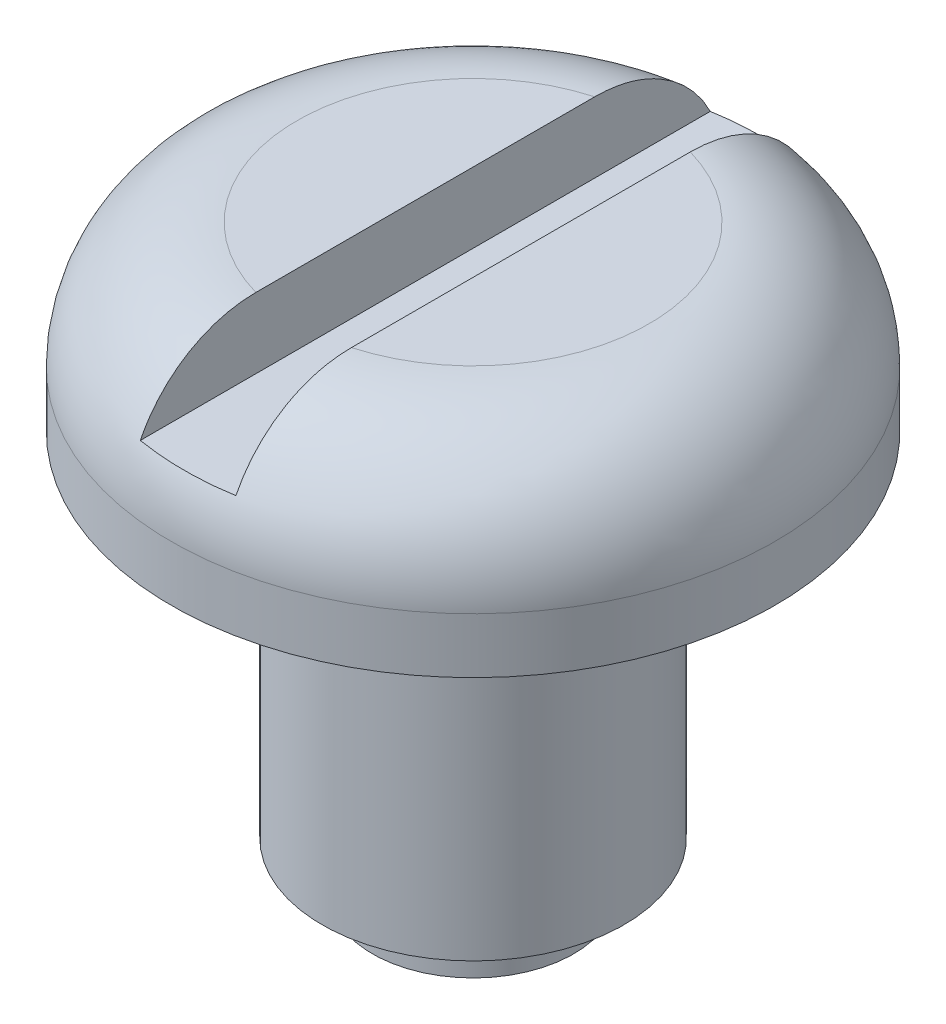
ISO-10303-21;
HEADER;
FILE_DESCRIPTION(('STEP AP214'),'2;1');
FILE_NAME('part.step','',(''),(''),'','','');
FILE_SCHEMA(('AUTOMOTIVE_DESIGN { 1 0 10303 214 1 1 1 1 }'));
ENDSEC;
DATA;
#1=APPLICATION_CONTEXT('core data for automotive mechanical design processes');
#2=APPLICATION_PROTOCOL_DEFINITION('international standard','automotive_design',2000,#1);
#3=PRODUCT_CONTEXT('',#1,'mechanical');
#4=PRODUCT('Part','Part','',(#3));
#5=PRODUCT_RELATED_PRODUCT_CATEGORY('part','',(#4));
#6=PRODUCT_DEFINITION_FORMATION('','',#4);
#7=PRODUCT_DEFINITION_CONTEXT('part definition',#1,'design');
#8=PRODUCT_DEFINITION('design','',#6,#7);
#9=PRODUCT_DEFINITION_SHAPE('','',#8);
#10=(LENGTH_UNIT() NAMED_UNIT(*) SI_UNIT(.MILLI.,.METRE.));
#11=(NAMED_UNIT(*) PLANE_ANGLE_UNIT() SI_UNIT($,.RADIAN.));
#12=(NAMED_UNIT(*) SI_UNIT($,.STERADIAN.) SOLID_ANGLE_UNIT());
#13=UNCERTAINTY_MEASURE_WITH_UNIT(LENGTH_MEASURE(1.E-05),#10,'distance_accuracy_value','');
#14=(GEOMETRIC_REPRESENTATION_CONTEXT(3) GLOBAL_UNCERTAINTY_ASSIGNED_CONTEXT((#13)) GLOBAL_UNIT_ASSIGNED_CONTEXT((#10,
#11,#12)) REPRESENTATION_CONTEXT('',''));
#15=CARTESIAN_POINT('',(0.,0.,0.));
#16=DIRECTION('',(0.,0.,1.));
#17=DIRECTION('',(1.,0.,0.));
#18=AXIS2_PLACEMENT_3D('',#15,#16,#17);
#19=CARTESIAN_POINT('',(3.49999999999998,11.6,0.));
#20=DIRECTION('',(0.,1.,0.));
#21=DIRECTION('',(0.,0.,1.));
#22=AXIS2_PLACEMENT_3D('',#19,#20,#21);
#23=PLANE('',#22);
#24=DIRECTION('',(0.,0.,1.));
#25=VECTOR('',#24,1.);
#26=CARTESIAN_POINT('',(-0.95,11.6,0.));
#27=LINE('',#26,#25);
#28=CARTESIAN_POINT('',(-0.95,11.6,-3.36860505254028));
#29=VERTEX_POINT('',#28);
#30=CARTESIAN_POINT('',(-0.95,11.6,3.36860505254028));
#31=VERTEX_POINT('',#30);
#32=EDGE_CURVE('E60',#29,#31,#27,.T.);
#33=ORIENTED_EDGE('',*,*,#32,.F.);
#34=CARTESIAN_POINT('',(0.,11.6,0.));
#35=DIRECTION('',(0.,-1.,0.));
#36=DIRECTION('',(0.,0.,-1.));
#37=AXIS2_PLACEMENT_3D('',#34,#35,#36);
#38=CIRCLE('',#37,3.49999999999998);
#39=EDGE_CURVE('E95',#31,#29,#38,.T.);
#40=ORIENTED_EDGE('',*,*,#39,.F.);
#41=EDGE_LOOP('',(#33,#40));
#42=FACE_BOUND('',#41,.T.);
#43=ADVANCED_FACE('F37',(#42),#23,.T.);
#44=CARTESIAN_POINT('',(0.,0.,0.));
#45=DIRECTION('',(0.,-1.,0.));
#46=DIRECTION('',(0.,0.,-1.));
#47=AXIS2_PLACEMENT_3D('',#44,#45,#46);
#48=PLANE('',#47);
#49=CARTESIAN_POINT('',(0.,0.,0.));
#50=DIRECTION('',(0.,-1.,0.));
#51=DIRECTION('',(0.,0.,-1.));
#52=AXIS2_PLACEMENT_3D('',#49,#50,#51);
#53=CIRCLE('',#52,2.);
#54=CARTESIAN_POINT('',(0.,0.,-2.));
#55=VERTEX_POINT('',#54);
#56=EDGE_CURVE('E83',#55,#55,#53,.T.);
#57=ORIENTED_EDGE('',*,*,#56,.T.);
#58=EDGE_LOOP('',(#57));
#59=FACE_BOUND('',#58,.T.);
#60=ADVANCED_FACE('F39',(#59),#48,.T.);
#61=CARTESIAN_POINT('',(0.,0.,0.));
#62=DIRECTION('',(0.,-1.,0.));
#63=DIRECTION('',(0.,0.,-1.));
#64=AXIS2_PLACEMENT_3D('',#61,#62,#63);
#65=CYLINDRICAL_SURFACE('',#64,2.);
#66=CARTESIAN_POINT('',(0.,1.,0.));
#67=DIRECTION('',(0.,-1.,0.));
#68=DIRECTION('',(0.,0.,-1.));
#69=AXIS2_PLACEMENT_3D('',#66,#67,#68);
#70=CIRCLE('',#69,2.);
#71=CARTESIAN_POINT('',(0.,1.,-2.));
#72=VERTEX_POINT('',#71);
#73=EDGE_CURVE('E118',#72,#72,#70,.T.);
#74=ORIENTED_EDGE('',*,*,#73,.T.);
#75=EDGE_LOOP('',(#74));
#76=FACE_BOUND('',#75,.T.);
#77=ORIENTED_EDGE('',*,*,#56,.F.);
#78=EDGE_LOOP('',(#77));
#79=FACE_BOUND('',#78,.T.);
#80=ADVANCED_FACE('F157',(#76,#79),#65,.T.);
#81=CARTESIAN_POINT('',(2.,1.,0.));
#82=DIRECTION('',(0.,-1.,0.));
#83=DIRECTION('',(0.,0.,-1.));
#84=AXIS2_PLACEMENT_3D('',#81,#82,#83);
#85=PLANE('',#84);
#86=CARTESIAN_POINT('',(0.,1.,0.));
#87=DIRECTION('',(0.,-1.,0.));
#88=DIRECTION('',(0.,0.,-1.));
#89=AXIS2_PLACEMENT_3D('',#86,#87,#88);
#90=CIRCLE('',#89,3.);
#91=CARTESIAN_POINT('',(0.,1.,-3.));
#92=VERTEX_POINT('',#91);
#93=EDGE_CURVE('E115',#92,#92,#90,.T.);
#94=ORIENTED_EDGE('',*,*,#93,.T.);
#95=EDGE_LOOP('',(#94));
#96=FACE_BOUND('',#95,.T.);
#97=ORIENTED_EDGE('',*,*,#73,.F.);
#98=EDGE_LOOP('',(#97));
#99=FACE_BOUND('',#98,.T.);
#100=ADVANCED_FACE('F162',(#96,#99),#85,.T.);
#101=CARTESIAN_POINT('',(0.,0.,0.));
#102=DIRECTION('',(0.,-1.,0.));
#103=DIRECTION('',(0.,0.,-1.));
#104=AXIS2_PLACEMENT_3D('',#101,#102,#103);
#105=CYLINDRICAL_SURFACE('',#104,3.);
#106=CARTESIAN_POINT('',(0.,8.,0.));
#107=DIRECTION('',(0.,-1.,0.));
#108=DIRECTION('',(0.,0.,-1.));
#109=AXIS2_PLACEMENT_3D('',#106,#107,#108);
#110=CIRCLE('',#109,3.);
#111=CARTESIAN_POINT('',(0.,8.,-3.));
#112=VERTEX_POINT('',#111);
#113=EDGE_CURVE('E112',#112,#112,#110,.T.);
#114=ORIENTED_EDGE('',*,*,#113,.T.);
#115=EDGE_LOOP('',(#114));
#116=FACE_BOUND('',#115,.T.);
#117=ORIENTED_EDGE('',*,*,#93,.F.);
#118=EDGE_LOOP('',(#117));
#119=FACE_BOUND('',#118,.T.);
#120=ADVANCED_FACE('F169',(#116,#119),#105,.T.);
#121=CARTESIAN_POINT('',(3.,8.,0.));
#122=DIRECTION('',(0.,-1.,0.));
#123=DIRECTION('',(0.,0.,-1.));
#124=AXIS2_PLACEMENT_3D('',#121,#122,#123);
#125=PLANE('',#124);
#126=CARTESIAN_POINT('',(0.,8.,0.));
#127=DIRECTION('',(0.,-1.,0.));
#128=DIRECTION('',(0.,0.,-1.));
#129=AXIS2_PLACEMENT_3D('',#126,#127,#128);
#130=CIRCLE('',#129,6.);
#131=CARTESIAN_POINT('',(0.,8.,-6.));
#132=VERTEX_POINT('',#131);
#133=EDGE_CURVE('E98',#132,#132,#130,.T.);
#134=ORIENTED_EDGE('',*,*,#133,.T.);
#135=EDGE_LOOP('',(#134));
#136=FACE_BOUND('',#135,.T.);
#137=ORIENTED_EDGE('',*,*,#113,.F.);
#138=EDGE_LOOP('',(#137));
#139=FACE_BOUND('',#138,.T.);
#140=ADVANCED_FACE('F175',(#136,#139),#125,.T.);
#141=CARTESIAN_POINT('',(0.,0.,0.));
#142=DIRECTION('',(0.,-1.,0.));
#143=DIRECTION('',(0.,0.,-1.));
#144=AXIS2_PLACEMENT_3D('',#141,#142,#143);
#145=CYLINDRICAL_SURFACE('',#144,6.);
#146=CARTESIAN_POINT('',(0.,9.09999999999998,0.));
#147=DIRECTION('',(0.,-1.,0.));
#148=DIRECTION('',(0.,0.,-1.));
#149=AXIS2_PLACEMENT_3D('',#146,#147,#148);
#150=CIRCLE('',#149,6.);
#151=CARTESIAN_POINT('',(0.,9.09999999999998,-6.));
#152=VERTEX_POINT('',#151);
#153=EDGE_CURVE('E94',#152,#152,#150,.T.);
#154=ORIENTED_EDGE('',*,*,#153,.T.);
#155=EDGE_LOOP('',(#154));
#156=FACE_BOUND('',#155,.T.);
#157=ORIENTED_EDGE('',*,*,#133,.F.);
#158=EDGE_LOOP('',(#157));
#159=FACE_BOUND('',#158,.T.);
#160=ADVANCED_FACE('F151',(#156,#159),#145,.T.);
#161=CARTESIAN_POINT('',(0.,9.1,0.));
#162=DIRECTION('',(0.,-1.,0.));
#163=DIRECTION('',(0.,0.,-1.));
#164=AXIS2_PLACEMENT_3D('',#161,#162,#163);
#165=TOROIDAL_SURFACE('',#164,3.5,2.5);
#166=CARTESIAN_POINT('',(-0.95,10.045469534161,0.70945879846611));
#167=CARTESIAN_POINT('',(-0.95,10.1416140487431,0.775091859484983));
#168=CARTESIAN_POINT('',(-0.95,10.2350944333296,0.844672755084913));
#169=CARTESIAN_POINT('',(-0.95,10.4161359003141,0.991242509142393));
#170=CARTESIAN_POINT('',(-0.95,10.5036935346659,1.0682356206363));
#171=CARTESIAN_POINT('',(-0.95,10.671560820077,1.22952391796088));
#172=CARTESIAN_POINT('',(-0.95,10.7518830167072,1.31380594778878));
#173=CARTESIAN_POINT('',(-0.95,10.9040492354143,1.4896167583465));
#174=CARTESIAN_POINT('',(-0.95,10.9758983429772,1.5811411365772));
#175=CARTESIAN_POINT('',(-0.95,11.1404287344557,1.81470823884872));
#176=CARTESIAN_POINT('',(-0.95,11.2276123565542,1.96071394098346));
#177=CARTESIAN_POINT('',(-0.95,11.3768068311368,2.26513697220366));
#178=CARTESIAN_POINT('',(-0.95,11.4388197743711,2.42355326912426));
#179=CARTESIAN_POINT('',(-0.95,11.5343704680833,2.74972849660206));
#180=CARTESIAN_POINT('',(-0.95,11.5677632154343,2.91753046682718));
#181=CARTESIAN_POINT('',(-0.95,11.6029617604577,3.25645471967969));
#182=CARTESIAN_POINT('',(-0.95,11.604778324089,3.4275758507107));
#183=CARTESIAN_POINT('',(-0.95,11.5769705315538,3.75233836506555));
#184=CARTESIAN_POINT('',(-0.95,11.5500477781149,3.90621310330304));
#185=CARTESIAN_POINT('',(-0.95,11.4691511047008,4.20668356061963));
#186=CARTESIAN_POINT('',(-0.95,11.4151868669979,4.35328186441092));
#187=CARTESIAN_POINT('',(-0.95,11.2854003590202,4.62615834253519));
#188=CARTESIAN_POINT('',(-0.95,11.2110121146868,4.75312008164712));
#189=CARTESIAN_POINT('',(-0.95,11.0413729894814,4.99224318545331));
#190=CARTESIAN_POINT('',(-0.95,10.9461264312464,5.10440760900869));
#191=CARTESIAN_POINT('',(-0.95,10.7405619604898,5.30736689464927));
#192=CARTESIAN_POINT('',(-0.95,10.6307650409084,5.39868989538579));
#193=CARTESIAN_POINT('',(-0.95,10.3971971492178,5.56126326460205));
#194=CARTESIAN_POINT('',(-0.95,10.2734274257545,5.63251542467825));
#195=CARTESIAN_POINT('',(-0.95,10.0174927080688,5.75183469943053));
#196=CARTESIAN_POINT('',(-0.95,9.88548555125737,5.80024058368454));
#197=CARTESIAN_POINT('',(-0.95,9.61518491078316,5.87401876732446));
#198=CARTESIAN_POINT('',(-0.95,9.47689174587541,5.89939223328805));
#199=CARTESIAN_POINT('',(-0.95,9.19903379924507,5.92624384463204));
#200=CARTESIAN_POINT('',(-0.95,9.05948581295493,5.92789609399271));
#201=CARTESIAN_POINT('',(-0.95,8.7821019377281,5.90770553681245));
#202=CARTESIAN_POINT('',(-0.95,8.64426601649274,5.88586317418803));
#203=CARTESIAN_POINT('',(-0.95,8.37445080562504,5.81938858149042));
#204=CARTESIAN_POINT('',(-0.95,8.24246215513494,5.77479432185197));
#205=CARTESIAN_POINT('',(-0.95,7.98780936146339,5.66415361181913));
#206=CARTESIAN_POINT('',(-0.949999999999999,7.86514527148209,5.5981070390425));
#207=CARTESIAN_POINT('',(-0.949999999999999,7.63213637191286,5.44623228413078));
#208=CARTESIAN_POINT('',(-0.949999999999999,7.5218361143564,5.36033577525491));
#209=CARTESIAN_POINT('',(-0.949999999999999,7.31705971919745,5.17140327483297));
#210=CARTESIAN_POINT('',(-0.949999999999999,7.22258389753884,5.06836694116238));
#211=CARTESIAN_POINT('',(-0.949999999999999,7.05112352036758,4.84707530398478));
#212=CARTESIAN_POINT('',(-0.949999999999999,6.97431358723923,4.72868476817521));
#213=CARTESIAN_POINT('',(-0.949999999999999,6.84126289153266,4.48086914124871));
#214=CARTESIAN_POINT('',(-0.949999999999999,6.78502385432481,4.35144312566032));
#215=CARTESIAN_POINT('',(-0.949999999999999,6.69352181594549,4.08275790592384));
#216=CARTESIAN_POINT('',(-0.949999999999999,6.65865846818326,3.94336277338751));
#217=CARTESIAN_POINT('',(-0.949999999999999,6.61205482127395,3.66079407105546));
#218=CARTESIAN_POINT('',(-0.949999999999999,6.60031445422881,3.51762051235594));
#219=CARTESIAN_POINT('',(-0.949999999999999,6.59968816227828,3.22661284529156));
#220=CARTESIAN_POINT('',(-0.949999999999999,6.61155316780732,3.07877766669755));
#221=CARTESIAN_POINT('',(-0.949999999999999,6.65854892273317,2.78684131766155));
#222=CARTESIAN_POINT('',(-0.949999999999999,6.69369054104184,2.64274192430777));
#223=CARTESIAN_POINT('',(-0.949999999999999,6.7881102259239,2.353276697076));
#224=CARTESIAN_POINT('',(-0.949999999999999,6.84869053700931,2.20833816429629));
#225=CARTESIAN_POINT('',(-0.949999999999999,6.99095120591536,1.92939080105897));
#226=CARTESIAN_POINT('',(-0.949999999999999,7.07262029986936,1.79537618607669));
#227=CARTESIAN_POINT('',(-0.949999999999999,7.22466839669676,1.58093394840016));
#228=CARTESIAN_POINT('',(-0.949999999999999,7.29030607068153,1.49707471044531));
#229=CARTESIAN_POINT('',(-0.949999999999999,7.42873645103895,1.33541659777511));
#230=CARTESIAN_POINT('',(-0.949999999999999,7.50153251967426,1.25762060198303));
#231=CARTESIAN_POINT('',(-0.949999999999999,7.653490477275,1.10795591658475));
#232=CARTESIAN_POINT('',(-0.95,7.73267540833287,1.0361107655477));
#233=CARTESIAN_POINT('',(-0.95,7.89622435779752,0.898666550640071));
#234=CARTESIAN_POINT('',(-0.95,7.98058585366163,0.833064483649101));
#235=CARTESIAN_POINT('',(-0.95,8.12091224799111,0.73203122925866));
#236=CARTESIAN_POINT('',(-0.95,8.17546386466649,0.69462028319236));
#237=CARTESIAN_POINT('',(-0.95,8.28634807048962,0.622450017340437));
#238=CARTESIAN_POINT('',(-0.95,8.34268168001869,0.58769225713506));
#239=CARTESIAN_POINT('',(-0.95,8.45717667331337,0.521443349916084));
#240=CARTESIAN_POINT('',(-0.95,8.51533600847617,0.489948700935211));
#241=CARTESIAN_POINT('',(-0.95,8.6338545052092,0.431537921862348));
#242=CARTESIAN_POINT('',(-0.95,8.6942106280051,0.404615738721223));
#243=CARTESIAN_POINT('',(-0.95,8.81349226589409,0.360203875735407));
#244=CARTESIAN_POINT('',(-0.95,8.87219476878363,0.342164805736643));
#245=CARTESIAN_POINT('',(-0.95,8.96174911381311,0.323799729320936));
#246=CARTESIAN_POINT('',(-0.95,8.99168633280882,0.319129179439449));
#247=CARTESIAN_POINT('',(-0.95,9.05189414525458,0.313164431769905));
#248=CARTESIAN_POINT('',(-0.95,9.08216455408474,0.311868450240882));
#249=CARTESIAN_POINT('',(-0.95,9.14283133494846,0.312831402663357));
#250=CARTESIAN_POINT('',(-0.95,9.17322734957132,0.315112061373021));
#251=CARTESIAN_POINT('',(-0.95,9.23360385580433,0.322961053743871));
#252=CARTESIAN_POINT('',(-0.95,9.26358390105215,0.328532675854681));
#253=CARTESIAN_POINT('',(-0.95,9.3532053666485,0.349384289438453));
#254=CARTESIAN_POINT('',(-0.95,9.41187022365416,0.368767994258214));
#255=CARTESIAN_POINT('',(-0.95,9.52043486745858,0.411339160279278));
#256=CARTESIAN_POINT('',(-0.95,9.57060203986092,0.433900175700824));
#257=CARTESIAN_POINT('',(-0.95,9.66938038031235,0.482269253543385));
#258=CARTESIAN_POINT('',(-0.95,9.71799053920775,0.508079370455377));
#259=CARTESIAN_POINT('',(-0.95,9.81378637782583,0.562027032974756));
#260=CARTESIAN_POINT('',(-0.95,9.86097413232847,0.590160939991453));
#261=CARTESIAN_POINT('',(-0.95,9.95412903550647,0.648389508183925));
#262=CARTESIAN_POINT('',(-0.95,10.0000959607968,0.678484524767778));
#263=CARTESIAN_POINT('',(-0.95,10.045469534161,0.70945879846611));
#264=B_SPLINE_CURVE_WITH_KNOTS('',3,(#166,#167,#168,#169,#170,#171,#172,#173,#174,#175,#176,
#177,#178,#179,#180,#181,#182,#183,#184,#185,#186,#187,#188,#189,#190,#191,#192,#193,#194,#195,
#196,#197,#198,#199,#200,#201,#202,#203,#204,#205,#206,#207,#208,#209,#210,#211,#212,#213,#214,
#215,#216,#217,#218,#219,#220,#221,#222,#223,#224,#225,#226,#227,#228,#229,#230,#231,#232,#233,
#234,#235,#236,#237,#238,#239,#240,#241,#242,#243,#244,#245,#246,#247,#248,#249,#250,#251,#252,
#253,#254,#255,#256,#257,#258,#259,#260,#261,#262,#263),.UNSPECIFIED.,.T.,.F.,(4,2,2,2,2,2,2,2,
2,2,2,2,2,2,2,2,2,2,2,2,2,2,2,2,2,2,2,2,2,2,2,2,2,2,2,2,2,2,2,2,2,2,2,2,2,2,2,2,4),(0.,
0.349184605071518,0.698570775783002,1.04733898872568,1.39589679653996,1.90384150241777,
2.41174400828616,2.92220482305143,3.43249159183091,3.89871142288769,4.3647644418991,
4.80403984364897,5.24322429681046,5.66959098450321,6.09591960108078,6.51571081906869,
6.93548077370573,7.35216820106945,7.76884775551419,8.18483418088272,8.60082297943338,
9.01826558943038,9.43571653291335,9.85713172165768,10.2785822482229,10.7076896443348,
11.1367957804187,11.5797708282356,12.0229528672575,12.4922942209393,12.9613854083281,
13.2804677051067,13.5997005957013,13.9201412533016,14.2404269813381,14.438805456114,
14.6372996566819,14.8355785775215,15.0335929346611,15.2169974061905,15.3077324695349,
15.3984195620819,15.4896596312919,15.580991025481,15.7655960743921,15.9305060052636,
16.0955207417305,16.260281825881,16.4250728528548),.UNSPECIFIED.);
#265=CARTESIAN_POINT('',(-0.95,10.2,5.66590337231854));
#266=VERTEX_POINT('',#265);
#267=EDGE_CURVE('E91',#31,#266,#264,.T.);
#268=ORIENTED_EDGE('',*,*,#267,.F.);
#269=ORIENTED_EDGE('',*,*,#39,.T.);
#270=CARTESIAN_POINT('',(-0.95,10.8497218449972,-5.19955588899603));
#271=CARTESIAN_POINT('',(-0.95,10.9510786345337,-5.09859018769521));
#272=CARTESIAN_POINT('',(-0.95,11.0437798834377,-4.98891119477848));
#273=CARTESIAN_POINT('',(-0.95,11.2093134307085,-4.75545348095874));
#274=CARTESIAN_POINT('',(-0.95,11.2821409141071,-4.63167135346074));
#275=CARTESIAN_POINT('',(-0.95,11.4060122924572,-4.37382003917742));
#276=CARTESIAN_POINT('',(-0.95,11.4570782401964,-4.23976142979214));
#277=CARTESIAN_POINT('',(-0.95,11.53645502789,-3.9651039767229));
#278=CARTESIAN_POINT('',(-0.95,11.5647671918438,-3.82450551408428));
#279=CARTESIAN_POINT('',(-0.95,11.5986841737629,-3.53773138881076));
#280=CARTESIAN_POINT('',(-0.95,11.6038185593627,-3.39150043736841));
#281=CARTESIAN_POINT('',(-0.95,11.5906065145456,-3.10011416813969));
#282=CARTESIAN_POINT('',(-0.95,11.5722541064486,-2.95495913364598));
#283=CARTESIAN_POINT('',(-0.95,11.511928979475,-2.66246630618612));
#284=CARTESIAN_POINT('',(-0.95,11.4688748836374,-2.51535277342012));
#285=CARTESIAN_POINT('',(-0.95,11.3606533007644,-2.22960528633201));
#286=CARTESIAN_POINT('',(-0.95,11.2954877090971,-2.09097060641562));
#287=CARTESIAN_POINT('',(-0.95,11.1392837044765,-1.81285894872169));
#288=CARTESIAN_POINT('',(-0.95,11.0464714148908,-1.67438423703079));
#289=CARTESIAN_POINT('',(-0.95,10.8420279364112,-1.41203054783174));
#290=CARTESIAN_POINT('',(-0.95,10.7303787686102,-1.28816570849101));
#291=CARTESIAN_POINT('',(-0.95,10.5416419137082,-1.10375108625651));
#292=CARTESIAN_POINT('',(-0.95,10.4693399593748,-1.03819033399731));
#293=CARTESIAN_POINT('',(-0.95,10.3202969610047,-0.912209499652883));
#294=CARTESIAN_POINT('',(-0.95,10.2435529427419,-0.851792930380014));
#295=CARTESIAN_POINT('',(-0.95,10.0859374950422,-0.736064250872224));
#296=CARTESIAN_POINT('',(-0.95,10.0050542368358,-0.680768202604814));
#297=CARTESIAN_POINT('',(-0.95,9.88089849370889,-0.602409155033277));
#298=CARTESIAN_POINT('',(-0.95,9.83905891879306,-0.577062962758733));
#299=CARTESIAN_POINT('',(-0.95,9.75434115634185,-0.528177028914781));
#300=CARTESIAN_POINT('',(-0.95,9.71146315636528,-0.504636964279858));
#301=CARTESIAN_POINT('',(-0.95,9.60226766322852,-0.448311490236694));
#302=CARTESIAN_POINT('',(-0.95,9.53519563373261,-0.416967905104546));
#303=CARTESIAN_POINT('',(-0.95,9.39781732461279,-0.363422275663805));
#304=CARTESIAN_POINT('',(-0.95,9.32754593285724,-0.341139827601942));
#305=CARTESIAN_POINT('',(-0.95,9.20588686953777,-0.317974763899737));
#306=CARTESIAN_POINT('',(-0.95,9.15544492394415,-0.312585380044068));
#307=CARTESIAN_POINT('',(-0.95,9.05451407822863,-0.311946181770886));
#308=CARTESIAN_POINT('',(-0.95,9.00402521374449,-0.316691345851819));
#309=CARTESIAN_POINT('',(-0.95,8.88354233264479,-0.338281556761914));
#310=CARTESIAN_POINT('',(-0.95,8.81439739864154,-0.359418566626339));
#311=CARTESIAN_POINT('',(-0.95,8.67915357959383,-0.410743771837354));
#312=CARTESIAN_POINT('',(-0.95,8.61309215957752,-0.441020540698788));
#313=CARTESIAN_POINT('',(-0.95,8.49959805782493,-0.498588938050593));
#314=CARTESIAN_POINT('',(-0.95,8.45159390874412,-0.524771176928567));
#315=CARTESIAN_POINT('',(-0.95,8.35687864951183,-0.579388521721131));
#316=CARTESIAN_POINT('',(-0.95,8.31016790075689,-0.607824248893123));
#317=CARTESIAN_POINT('',(-0.95,8.17170918635193,-0.696001646980186));
#318=CARTESIAN_POINT('',(-0.95,8.08174039867632,-0.758557694857592));
#319=CARTESIAN_POINT('',(-0.95,7.9070068291769,-0.890063769202404));
#320=CARTESIAN_POINT('',(-0.949999999999999,7.82222866668374,-0.958996096258051));
#321=CARTESIAN_POINT('',(-0.949999999999999,7.6584597959476,-1.10331616938133));
#322=CARTESIAN_POINT('',(-0.949999999999999,7.57946375108916,-1.1786978200004));
#323=CARTESIAN_POINT('',(-0.949999999999999,7.43930034307323,-1.32442976354172));
#324=CARTESIAN_POINT('',(-0.949999999999999,7.37721667949453,-1.39389874995899));
#325=CARTESIAN_POINT('',(-0.949999999999999,7.25865377250425,-1.53750182856111));
#326=CARTESIAN_POINT('',(-0.949999999999999,7.20217537356812,-1.61163662094383));
#327=CARTESIAN_POINT('',(-0.949999999999999,7.09562625493937,-1.76425905571648));
#328=CARTESIAN_POINT('',(-0.949999999999999,7.04554804656747,-1.84274145400181));
#329=CARTESIAN_POINT('',(-0.949999999999999,6.95243447675432,-2.00378472662512));
#330=CARTESIAN_POINT('',(-0.949999999999999,6.90939868548506,-2.08634535165125));
#331=CARTESIAN_POINT('',(-0.949999999999999,6.8307088155024,-2.25576363781549));
#332=CARTESIAN_POINT('',(-0.949999999999999,6.79511929272419,-2.34265139334649));
#333=CARTESIAN_POINT('',(-0.949999999999999,6.73240008771929,-2.51942567917498));
#334=CARTESIAN_POINT('',(-0.949999999999999,6.70526948380658,-2.60931188157863));
#335=CARTESIAN_POINT('',(-0.949999999999999,6.65998684787939,-2.79136330856469));
#336=CARTESIAN_POINT('',(-0.949999999999999,6.6418375066655,-2.88352920747448));
#337=CARTESIAN_POINT('',(-0.949999999999999,6.61494739897047,-3.06918566062187));
#338=CARTESIAN_POINT('',(-0.949999999999999,6.6062050033692,-3.16267598265002));
#339=CARTESIAN_POINT('',(-0.949999999999999,6.59565258416105,-3.41775173723048));
#340=CARTESIAN_POINT('',(-0.949999999999999,6.60338145607083,-3.57984729902757));
#341=CARTESIAN_POINT('',(-0.949999999999999,6.64831675976508,-3.89975571525107));
#342=CARTESIAN_POINT('',(-0.949999999999999,6.6855000655167,-4.05757182917268));
#343=CARTESIAN_POINT('',(-0.949999999999999,6.78461671480064,-4.35167511379956));
#344=CARTESIAN_POINT('',(-0.949999999999999,6.84441348491623,-4.48868336026205));
#345=CARTESIAN_POINT('',(-0.949999999999999,6.98701163867189,-4.75016012649691));
#346=CARTESIAN_POINT('',(-0.949999999999999,7.06980841996102,-4.87463114821184));
#347=CARTESIAN_POINT('',(-0.949999999999999,7.25263398313491,-5.10274219538045));
#348=CARTESIAN_POINT('',(-0.949999999999999,7.35191894445905,-5.20697901341654));
#349=CARTESIAN_POINT('',(-0.949999999999999,7.56687818507304,-5.39690370132507));
#350=CARTESIAN_POINT('',(-0.95,7.68255036404585,-5.48259394472283));
#351=CARTESIAN_POINT('',(-0.95,7.92459066423259,-5.63133820021385));
#352=CARTESIAN_POINT('',(-0.95,8.05071305706077,-5.69479232628426));
#353=CARTESIAN_POINT('',(-0.95,8.31189280308731,-5.79938945724632));
#354=CARTESIAN_POINT('',(-0.95,8.44694958226501,-5.8405338939424));
#355=CARTESIAN_POINT('',(-0.95,8.72075722596601,-5.89898262774744));
#356=CARTESIAN_POINT('',(-0.95,8.85945976600651,-5.91651351539559));
#357=CARTESIAN_POINT('',(-0.95,9.13783867074584,-5.92795208374311));
#358=CARTESIAN_POINT('',(-0.95,9.27751503709275,-5.92185972445364));
#359=CARTESIAN_POINT('',(-0.95,9.55337409729314,-5.8862948364704));
#360=CARTESIAN_POINT('',(-0.95,9.6895669940185,-5.85690131029639));
#361=CARTESIAN_POINT('',(-0.95,9.95507985771221,-5.77570478620763));
#362=CARTESIAN_POINT('',(-0.95,10.0844009437829,-5.72390544980656));
#363=CARTESIAN_POINT('',(-0.95,10.3267297778681,-5.60235865121457));
#364=CARTESIAN_POINT('',(-0.95,10.4402180567346,-5.53356630204615));
#365=CARTESIAN_POINT('',(-0.95,10.6548463376764,-5.37885276250308));
#366=CARTESIAN_POINT('',(-0.95,10.7559855592874,-5.29293049041445));
#367=CARTESIAN_POINT('',(-0.95,10.8497218449972,-5.19955588899603));
#368=B_SPLINE_CURVE_WITH_KNOTS('',3,(#270,#271,#272,#273,#274,#275,#276,#277,#278,#279,#280,
#281,#282,#283,#284,#285,#286,#287,#288,#289,#290,#291,#292,#293,#294,#295,#296,#297,#298,#299,
#300,#301,#302,#303,#304,#305,#306,#307,#308,#309,#310,#311,#312,#313,#314,#315,#316,#317,#318,
#319,#320,#321,#322,#323,#324,#325,#326,#327,#328,#329,#330,#331,#332,#333,#334,#335,#336,#337,
#338,#339,#340,#341,#342,#343,#344,#345,#346,#347,#348,#349,#350,#351,#352,#353,#354,#355,#356,
#357,#358,#359,#360,#361,#362,#363,#364,#365,#366,#367),.UNSPECIFIED.,.T.,.F.,(4,2,2,2,2,2,2,2,
2,2,2,2,2,2,2,2,2,2,2,2,2,2,2,2,2,2,2,2,2,2,2,2,2,2,2,2,2,2,2,2,2,2,2,2,2,2,2,2,4),(0.,
0.428708087571796,0.857519949482452,1.28589622102122,1.7142475643537,2.15125504366662,
2.58837376892342,3.0462720148785,3.50413102031455,4.00233602664378,4.50101926433228,
4.79361029065538,5.08639954267188,5.38007812841568,5.52679886451657,5.67349329491644,
5.8953402098089,6.11517320169051,6.26644518077817,6.41764222448124,6.63322193321211,
6.85096182060266,7.01492788848685,7.17893931799394,7.50731954097621,7.83481413075333,
8.16200254445252,8.44124748669175,8.72053443562955,8.99949154739422,9.27843162689037,
9.55969803469703,9.84093378492327,10.1222537428913,10.4035249732673,10.8875351684661,
11.3711657211769,11.8173923748037,12.2635298017725,12.6932961292217,13.1230074241261,
13.5445329190756,13.96603135791,14.3834556671181,14.8008806829317,15.2168964428244,
15.632844243905,16.0292948981075,16.4257705951623),.UNSPECIFIED.);
#369=CARTESIAN_POINT('',(-0.95,10.2,-5.66590337231854));
#370=VERTEX_POINT('',#369);
#371=EDGE_CURVE('E101',#370,#29,#368,.T.);
#372=ORIENTED_EDGE('',*,*,#371,.F.);
#373=CARTESIAN_POINT('',(0.,10.2,0.));
#374=DIRECTION('',(0.,-1.,0.));
#375=DIRECTION('',(0.,0.,-1.));
#376=AXIS2_PLACEMENT_3D('',#373,#374,#375);
#377=CIRCLE('',#376,5.74499443206436);
#378=CARTESIAN_POINT('',(0.95,10.2,-5.66590337231854));
#379=VERTEX_POINT('',#378);
#380=EDGE_CURVE('E41',#379,#370,#377,.F.);
#381=ORIENTED_EDGE('',*,*,#380,.F.);
#382=CARTESIAN_POINT('',(0.95,10.8497218449972,-5.19955588899603));
#383=CARTESIAN_POINT('',(0.95,10.7508776719932,-5.29800763159641));
#384=CARTESIAN_POINT('',(0.95,10.6436521241741,-5.38831233170377));
#385=CARTESIAN_POINT('',(0.95,10.4154280963133,-5.54980412966357));
#386=CARTESIAN_POINT('',(0.95,10.2944015448691,-5.6209512365935));
#387=CARTESIAN_POINT('',(0.95,10.0421305564332,-5.74182620440004));
#388=CARTESIAN_POINT('',(0.95,9.91089124608127,-5.7915647311786));
#389=CARTESIAN_POINT('',(0.95,9.64196273631587,-5.86814331422495));
#390=CARTESIAN_POINT('',(0.95,9.50427657059786,-5.89499402880636));
#391=CARTESIAN_POINT('',(0.95,9.22704245998914,-5.92496195089261));
#392=CARTESIAN_POINT('',(0.95,9.08750727498546,-5.92819721868451));
#393=CARTESIAN_POINT('',(0.95,8.80987269520328,-5.91114790908779));
#394=CARTESIAN_POINT('',(0.95,8.67177338825852,-5.89086190132657));
#395=CARTESIAN_POINT('',(0.95,8.40120370376434,-5.82743093197578));
#396=CARTESIAN_POINT('',(0.95,8.26872330424889,-5.78432869241806));
#397=CARTESIAN_POINT('',(0.95,8.01284764617331,-5.67656519754043));
#398=CARTESIAN_POINT('',(0.95,7.88945234421859,-5.6119040452039));
#399=CARTESIAN_POINT('',(0.95,7.65478201316178,-5.46267126992815));
#400=CARTESIAN_POINT('',(0.949999999999999,7.54354856990589,-5.37803427738114));
#401=CARTESIAN_POINT('',(0.949999999999999,7.33671289547024,-5.19144378509911));
#402=CARTESIAN_POINT('',(0.949999999999999,7.24111103171941,-5.08948987843525));
#403=CARTESIAN_POINT('',(0.949999999999999,7.06725077478334,-4.8701908757355));
#404=CARTESIAN_POINT('',(0.949999999999999,6.9891614443163,-4.75271181273097));
#405=CARTESIAN_POINT('',(0.949999999999999,6.85342867638958,-4.50649476779342));
#406=CARTESIAN_POINT('',(0.949999999999999,6.79578647068641,-4.37775610815248));
#407=CARTESIAN_POINT('',(0.949999999999999,6.70139063299173,-4.11026658901082));
#408=CARTESIAN_POINT('',(0.949999999999999,6.66502655963734,-3.97137842536073));
#409=CARTESIAN_POINT('',(0.949999999999999,6.61537052987285,-3.68955907886564));
#410=CARTESIAN_POINT('',(0.949999999999999,6.60208048397009,-3.54662756223057));
#411=CARTESIAN_POINT('',(0.949999999999999,6.59831354015733,-3.25593391803148));
#412=CARTESIAN_POINT('',(0.949999999999999,6.60857559486653,-3.10816272502631));
#413=CARTESIAN_POINT('',(0.949999999999999,6.65239711476376,-2.81615026364774));
#414=CARTESIAN_POINT('',(0.949999999999999,6.68596061391723,-2.67190961096131));
#415=CARTESIAN_POINT('',(0.949999999999999,6.77715469497617,-2.38212891508809));
#416=CARTESIAN_POINT('',(0.949999999999999,6.83605884922919,-2.23699157060508));
#417=CARTESIAN_POINT('',(0.949999999999999,6.97508839203724,-1.95732397393391));
#418=CARTESIAN_POINT('',(0.949999999999999,7.05522044257035,-1.82279706886343));
#419=CARTESIAN_POINT('',(0.949999999999999,7.24316207559968,-1.55222905226473));
#420=CARTESIAN_POINT('',(0.949999999999999,7.35304186994697,-1.41763604462925));
#421=CARTESIAN_POINT('',(0.949999999999999,7.59016973821128,-1.16487652192887));
#422=CARTESIAN_POINT('',(0.95,7.71741857475884,-1.04671072860135));
#423=CARTESIAN_POINT('',(0.95,7.90544718373348,-0.892317018109479));
#424=CARTESIAN_POINT('',(0.95,7.96071236874267,-0.84917966423403));
#425=CARTESIAN_POINT('',(0.95,8.07326849167536,-0.765639982902659));
#426=CARTESIAN_POINT('',(0.95,8.13055896288874,-0.725237031500984));
#427=CARTESIAN_POINT('',(0.95,8.24728350273201,-0.647216321821816));
#428=CARTESIAN_POINT('',(0.95,8.30672411204893,-0.609608351840535));
#429=CARTESIAN_POINT('',(0.95,8.42765899666533,-0.537886095212405));
#430=CARTESIAN_POINT('',(0.95,8.48915213464521,-0.503769915000165));
#431=CARTESIAN_POINT('',(0.95,8.61628315829598,-0.439532136706456));
#432=CARTESIAN_POINT('',(0.95,8.68198776460939,-0.409540803847315));
#433=CARTESIAN_POINT('',(0.95,8.81657529250782,-0.358722250401553));
#434=CARTESIAN_POINT('',(0.95,8.88542568680522,-0.337817766617758));
#435=CARTESIAN_POINT('',(0.95,9.00557231568203,-0.316503347174447));
#436=CARTESIAN_POINT('',(0.95,9.05603978438949,-0.311861256103888));
#437=CARTESIAN_POINT('',(0.95,9.1568875824297,-0.312692061766522));
#438=CARTESIAN_POINT('',(0.95,9.20726790037922,-0.318166192706457));
#439=CARTESIAN_POINT('',(0.95,9.32947051418737,-0.341616360802055));
#440=CARTESIAN_POINT('',(0.95,9.40031032407205,-0.364239389341614));
#441=CARTESIAN_POINT('',(0.95,9.53881647041529,-0.41854269913034));
#442=CARTESIAN_POINT('',(0.95,9.60644526713792,-0.450308880894092));
#443=CARTESIAN_POINT('',(0.95,9.72190530507579,-0.51014705562345));
#444=CARTESIAN_POINT('',(0.95,9.77034491558256,-0.537059552107388));
#445=CARTESIAN_POINT('',(0.95,9.86591794000489,-0.593120880199278));
#446=CARTESIAN_POINT('',(0.95,9.91305100286614,-0.622270305066129));
#447=CARTESIAN_POINT('',(0.95,10.0527320956185,-0.712607182262994));
#448=CARTESIAN_POINT('',(0.95,10.1434619235918,-0.77662940741));
#449=CARTESIAN_POINT('',(0.95,10.3194959155715,-0.911199467165009));
#450=CARTESIAN_POINT('',(0.95,10.404815494334,-0.981727213372514));
#451=CARTESIAN_POINT('',(0.95,10.5694102246096,-1.12941383971957));
#452=CARTESIAN_POINT('',(0.95,10.648690827807,-1.20656660197433));
#453=CARTESIAN_POINT('',(0.95,10.7877050962604,-1.35426653670713));
#454=CARTESIAN_POINT('',(0.95,10.848507411984,-1.42380834630388));
#455=CARTESIAN_POINT('',(0.95,10.9645032290293,-1.56745587162147));
#456=CARTESIAN_POINT('',(0.95,11.0196960089173,-1.64156217241116));
#457=CARTESIAN_POINT('',(0.95,11.1237028694076,-1.79403251740646));
#458=CARTESIAN_POINT('',(0.95,11.1725229692899,-1.87239244333551));
#459=CARTESIAN_POINT('',(0.95,11.263154711343,-2.03307210343633));
#460=CARTESIAN_POINT('',(0.95,11.3049667298881,-2.11539162464922));
#461=CARTESIAN_POINT('',(0.95,11.3812444981553,-2.28417704813316));
#462=CARTESIAN_POINT('',(0.95,11.4156484720278,-2.37067096922886));
#463=CARTESIAN_POINT('',(0.95,11.4760835392761,-2.54653350691623));
#464=CARTESIAN_POINT('',(0.95,11.5021155079322,-2.63590182191915));
#465=CARTESIAN_POINT('',(0.95,11.5453069579027,-2.81678655696861));
#466=CARTESIAN_POINT('',(0.95,11.5624652003899,-2.90830327508218));
#467=CARTESIAN_POINT('',(0.95,11.5875073610951,-3.09256008004325));
#468=CARTESIAN_POINT('',(0.95,11.5953928242916,-3.18529996048978));
#469=CARTESIAN_POINT('',(0.95,11.6038506223803,-3.43912102275288));
#470=CARTESIAN_POINT('',(0.95,11.594872478736,-3.60063559073296));
#471=CARTESIAN_POINT('',(0.95,11.5476087412607,-3.9192752058893));
#472=CARTESIAN_POINT('',(0.95,11.5093294372473,-4.0764011876222));
#473=CARTESIAN_POINT('',(0.95,11.4081911466014,-4.36936522598758));
#474=CARTESIAN_POINT('',(0.95,11.3473877498492,-4.50591628290906));
#475=CARTESIAN_POINT('',(0.95,11.2029467643356,-4.7660817003362));
#476=CARTESIAN_POINT('',(0.95,11.1193669825059,-4.88972772992276));
#477=CARTESIAN_POINT('',(0.95,10.9980929630631,-5.03884638843969));
#478=CARTESIAN_POINT('',(0.95,10.9696000747323,-5.07206612914828));
#479=CARTESIAN_POINT('',(0.95,10.9109204416005,-5.13697655373738));
#480=CARTESIAN_POINT('',(0.95,10.8807336560536,-5.16866720080221));
#481=CARTESIAN_POINT('',(0.95,10.8497218449972,-5.19955588899603));
#482=B_SPLINE_CURVE_WITH_KNOTS('',3,(#382,#383,#384,#385,#386,#387,#388,#389,#390,#391,#392,
#393,#394,#395,#396,#397,#398,#399,#400,#401,#402,#403,#404,#405,#406,#407,#408,#409,#410,#411,
#412,#413,#414,#415,#416,#417,#418,#419,#420,#421,#422,#423,#424,#425,#426,#427,#428,#429,#430,
#431,#432,#433,#434,#435,#436,#437,#438,#439,#440,#441,#442,#443,#444,#445,#446,#447,#448,#449,
#450,#451,#452,#453,#454,#455,#456,#457,#458,#459,#460,#461,#462,#463,#464,#465,#466,#467,#468,
#469,#470,#471,#472,#473,#474,#475,#476,#477,#478,#479,#480,#481),.UNSPECIFIED.,.T.,.F.,(4,2,2,
2,2,2,2,2,2,2,2,2,2,2,2,2,2,2,2,2,2,2,2,2,2,2,2,2,2,2,2,2,2,2,2,2,2,2,2,2,2,2,2,2,2,2,2,2,2,4),
(0.,0.418362562328125,0.837591790645921,1.25661191363923,1.67543680209109,2.09216642341772,
2.50892138817859,2.92489875015764,3.34087412510966,3.75823010199613,4.1755958876562,
4.59683225670472,5.01809399717187,5.44684462279987,5.87563074687596,6.3180532680967,
6.76055240097795,7.22851022202178,7.69661507721043,8.21599245750634,8.73539264968439,
8.94566164436451,9.15588249620562,9.36680789588446,9.57761829977177,9.79403154588143,
10.0085668677883,10.1596700563821,10.3107916811951,10.5325372026223,10.7564381266918,
10.922605898758,11.0888178937351,11.421581815535,11.7533505582327,12.0848161570679,
12.3616814290105,12.6385822632323,12.9152196299993,13.1918421349803,13.4706889971881,
13.749506696905,14.028363310799,14.3071734565812,14.78965910088,15.2720412033411,
15.7182956810708,16.1634279378743,16.2946837127804,16.425942646329),.UNSPECIFIED.);
#483=CARTESIAN_POINT('',(0.95,11.6,-3.36860505254028));
#484=VERTEX_POINT('',#483);
#485=EDGE_CURVE('E78',#484,#379,#482,.T.);
#486=ORIENTED_EDGE('',*,*,#485,.F.);
#487=CARTESIAN_POINT('',(0.95,11.6,3.36860505254028));
#488=VERTEX_POINT('',#487);
#489=EDGE_CURVE('E89',#484,#488,#38,.T.);
#490=ORIENTED_EDGE('',*,*,#489,.T.);
#491=CARTESIAN_POINT('',(0.95,10.045469534161,0.70945879846611));
#492=CARTESIAN_POINT('',(0.95,9.9965533263403,0.676066055787141));
#493=CARTESIAN_POINT('',(0.95,9.94694724539335,0.643694753337374));
#494=CARTESIAN_POINT('',(0.95,9.8462779100943,0.58123190611429));
#495=CARTESIAN_POINT('',(0.95,9.79521398147624,0.551141440555131));
#496=CARTESIAN_POINT('',(0.95,9.69157840344089,0.493868258380235));
#497=CARTESIAN_POINT('',(0.95,9.63900956500308,0.466680518637567));
#498=CARTESIAN_POINT('',(0.95,9.5319938908585,0.416396451883366));
#499=CARTESIAN_POINT('',(0.95,9.47754936028171,0.393295302893016));
#500=CARTESIAN_POINT('',(0.95,9.36724768518387,0.354197018160995));
#501=CARTESIAN_POINT('',(0.95,9.31144421757143,0.338060882468455));
#502=CARTESIAN_POINT('',(0.95,9.2264561533133,0.321897374707792));
#503=CARTESIAN_POINT('',(0.95,9.1980511759112,0.317850138566789));
#504=CARTESIAN_POINT('',(0.95,9.14097274203422,0.312813235185302));
#505=CARTESIAN_POINT('',(0.95,9.11229941135365,0.311822200891745));
#506=CARTESIAN_POINT('',(0.95,9.05490598715078,0.313021941807548));
#507=CARTESIAN_POINT('',(0.95,9.02618617121248,0.315225561989496));
#508=CARTESIAN_POINT('',(0.95,8.96911525274233,0.322571586620493));
#509=CARTESIAN_POINT('',(0.95,8.94076449384894,0.327716553992013));
#510=CARTESIAN_POINT('',(0.95,8.85596153440126,0.34690973759527));
#511=CARTESIAN_POINT('',(0.95,8.80036499078544,0.364685209735697));
#512=CARTESIAN_POINT('',(0.95,8.70840564129134,0.399684260478168));
#513=CARTESIAN_POINT('',(0.95,8.67140759868337,0.415381447755578));
#514=CARTESIAN_POINT('',(0.95,8.59832630402744,0.448810790199259));
#515=CARTESIAN_POINT('',(0.95,8.5622432681209,0.466543420807195));
#516=CARTESIAN_POINT('',(0.95,8.4550577835233,0.522071496686364));
#517=CARTESIAN_POINT('',(0.95,8.3851437163424,0.562145365286961));
#518=CARTESIAN_POINT('',(0.95,8.24785176161607,0.646586684194031));
#519=CARTESIAN_POINT('',(0.95,8.18047795062112,0.690960659193432));
#520=CARTESIAN_POINT('',(0.95,8.04840436109779,0.783377938284281));
#521=CARTESIAN_POINT('',(0.95,7.98370179064339,0.831417253711657));
#522=CARTESIAN_POINT('',(0.95,7.8505970598123,0.93616353050353));
#523=CARTESIAN_POINT('',(0.949999999999999,7.78249545316145,0.993254214948535));
#524=CARTESIAN_POINT('',(0.949999999999999,7.65013096363149,1.11174577563658));
#525=CARTESIAN_POINT('',(0.949999999999999,7.58586938097203,1.17314809664998));
#526=CARTESIAN_POINT('',(0.949999999999999,7.40017045829539,1.36336771569496));
#527=CARTESIAN_POINT('',(0.949999999999999,7.2851923218655,1.49868323719124));
#528=CARTESIAN_POINT('',(0.949999999999999,7.08092770777296,1.78114982164312));
#529=CARTESIAN_POINT('',(0.949999999999999,6.99094961191632,1.92779774167793));
#530=CARTESIAN_POINT('',(0.949999999999999,6.83633072134046,2.23430294383045));
#531=CARTESIAN_POINT('',(0.949999999999999,6.77172511632192,2.3941782020505));
#532=CARTESIAN_POINT('',(0.949999999999999,6.67159869754671,2.72372951534496));
#533=CARTESIAN_POINT('',(0.949999999999999,6.63621881875674,2.8934488860385));
#534=CARTESIAN_POINT('',(0.949999999999999,6.59781234996339,3.23647672511068));
#535=CARTESIAN_POINT('',(0.949999999999999,6.5947591093821,3.40978211898177));
#536=CARTESIAN_POINT('',(0.949999999999999,6.62085695331604,3.73715574425988));
#537=CARTESIAN_POINT('',(0.949999999999999,6.64694036571901,3.89147169497373));
#538=CARTESIAN_POINT('',(0.949999999999999,6.72628721004234,4.19297057836653));
#539=CARTESIAN_POINT('',(0.949999999999999,6.77954311687816,4.34015547355248));
#540=CARTESIAN_POINT('',(0.949999999999999,6.9080241858679,4.61409225675046));
#541=CARTESIAN_POINT('',(0.949999999999999,6.98177698483703,4.74153632647835));
#542=CARTESIAN_POINT('',(0.949999999999999,7.15024321586263,4.98171861603842));
#543=CARTESIAN_POINT('',(0.949999999999999,7.24495177554473,5.09446024463158));
#544=CARTESIAN_POINT('',(0.949999999999999,7.44953885126333,5.29860166600362));
#545=CARTESIAN_POINT('',(0.949999999999999,7.5588877315249,5.39053271856419));
#546=CARTESIAN_POINT('',(0.949999999999999,7.79167246955704,5.55438670958913));
#547=CARTESIAN_POINT('',(0.95,7.91510712387991,5.62631135554067));
#548=CARTESIAN_POINT('',(0.95,8.17047774046362,5.74699775437149));
#549=CARTESIAN_POINT('',(0.95,8.30225238652998,5.7961010666555));
#550=CARTESIAN_POINT('',(0.95,8.57220974020741,5.87130088224024));
#551=CARTESIAN_POINT('',(0.95,8.71039211394758,5.89739858282025));
#552=CARTESIAN_POINT('',(0.95,8.98813938519554,5.92569674658171));
#553=CARTESIAN_POINT('',(0.95,9.12768633987774,5.9280736150009));
#554=CARTESIAN_POINT('',(0.95,9.40518979247832,5.909320189336));
#555=CARTESIAN_POINT('',(0.95,9.54314632079209,5.88819034525466));
#556=CARTESIAN_POINT('',(0.95,9.81330879200567,5.82310908549712));
#557=CARTESIAN_POINT('',(0.95,9.94552433832792,5.7791975088453));
#558=CARTESIAN_POINT('',(0.95,10.2007409837166,5.66987280886743));
#559=CARTESIAN_POINT('',(0.95,10.3237420366932,5.60445957800171));
#560=CARTESIAN_POINT('',(0.95,10.5575155278343,5.45379233435688));
#561=CARTESIAN_POINT('',(0.95,10.6682448072972,5.36847138231584));
#562=CARTESIAN_POINT('',(0.95,10.8739673243213,5.18060868673534));
#563=CARTESIAN_POINT('',(0.95,10.9689602249628,5.0780665745812));
#564=CARTESIAN_POINT('',(0.95,11.1415220959153,4.85768453052196));
#565=CARTESIAN_POINT('',(0.95,11.2189190255023,4.73970995564542));
#566=CARTESIAN_POINT('',(0.95,11.353200102451,4.49262304045925));
#567=CARTESIAN_POINT('',(0.95,11.4100826963652,4.36350985759583));
#568=CARTESIAN_POINT('',(0.95,11.5029118397324,4.09536773764498));
#569=CARTESIAN_POINT('',(0.95,11.5384632766088,3.95620218774806));
#570=CARTESIAN_POINT('',(0.95,11.5864654717017,3.67397300051944));
#571=CARTESIAN_POINT('',(0.95,11.5989156572378,3.5309092666409));
#572=CARTESIAN_POINT('',(0.95,11.6009807431135,3.24004568749373));
#573=CARTESIAN_POINT('',(0.95,11.5898505565674,3.09224108546827));
#574=CARTESIAN_POINT('',(0.95,11.5443091697605,2.80026632774555));
#575=CARTESIAN_POINT('',(0.95,11.5098893480172,2.65609753848071));
#576=CARTESIAN_POINT('',(0.95,11.4169450219594,2.36647564673933));
#577=CARTESIAN_POINT('',(0.95,11.357130694648,2.22143884986414));
#578=CARTESIAN_POINT('',(0.95,11.216342831487,1.94215678802277));
#579=CARTESIAN_POINT('',(0.95,11.1353746061845,1.8079088256354));
#580=CARTESIAN_POINT('',(0.95,10.978569378224,1.58466203944221));
#581=CARTESIAN_POINT('',(0.95,10.9066735142171,1.49284431340646));
#582=CARTESIAN_POINT('',(0.95,10.7543571585437,1.31647544155606));
#583=CARTESIAN_POINT('',(0.95,10.6739307678424,1.23192939839245));
#584=CARTESIAN_POINT('',(0.95,10.5056237373266,1.06996456308211));
#585=CARTESIAN_POINT('',(0.95,10.417714599542,0.992575595781691));
#586=CARTESIAN_POINT('',(0.95,10.2359204422533,0.845286920188377));
#587=CARTESIAN_POINT('',(0.95,10.1420393510003,0.775382368340761));
#588=CARTESIAN_POINT('',(0.95,10.045469534161,0.70945879846611));
#589=B_SPLINE_CURVE_WITH_KNOTS('',3,(#491,#492,#493,#494,#495,#496,#497,#498,#499,#500,#501,
#502,#503,#504,#505,#506,#507,#508,#509,#510,#511,#512,#513,#514,#515,#516,#517,#518,#519,#520,
#521,#522,#523,#524,#525,#526,#527,#528,#529,#530,#531,#532,#533,#534,#535,#536,#537,#538,#539,
#540,#541,#542,#543,#544,#545,#546,#547,#548,#549,#550,#551,#552,#553,#554,#555,#556,#557,#558,
#559,#560,#561,#562,#563,#564,#565,#566,#567,#568,#569,#570,#571,#572,#573,#574,#575,#576,#577,
#578,#579,#580,#581,#582,#583,#584,#585,#586,#587,#588),.UNSPECIFIED.,.T.,.F.,(4,2,2,2,2,2,2,2,
2,2,2,2,2,2,2,2,2,2,2,2,2,2,2,2,2,2,2,2,2,2,2,2,2,2,2,2,2,2,2,2,2,2,2,2,2,2,2,2,4),(0.,
0.177655756537927,0.355395055670827,0.532821616293977,0.710037405101494,0.883531567597326,
0.969464467123421,1.05535892289077,1.14159969986366,1.22791573692145,1.40234084385773,
1.52287349851683,1.64343436487289,1.8849596931728,2.12685741160315,2.3684955490484,
2.63490109817324,2.9013963461074,3.4320274849507,3.94604664963628,4.46077622294365,
4.97797371624847,5.49474479074872,5.96183726821439,6.42880046037924,6.86836508275282,
7.30782761019,7.73433230374291,8.16080058521488,8.58066238821067,9.0005023390807,
9.41721770931889,9.83392510226831,10.2499062318988,10.665889442074,11.0832920735747,
11.5007036406148,11.9220358821446,12.3434000223514,12.772345670361,13.2013019517986,
13.6440140346573,14.0868900927836,14.5556190966893,15.0242305421408,15.3735452802335,
15.7231031712981,16.0740576411804,16.4247835995827),.UNSPECIFIED.);
#590=CARTESIAN_POINT('',(0.95,10.2,5.66590337231854));
#591=VERTEX_POINT('',#590);
#592=EDGE_CURVE('E52',#591,#488,#589,.T.);
#593=ORIENTED_EDGE('',*,*,#592,.F.);
#594=EDGE_CURVE('E11',#266,#591,#377,.F.);
#595=ORIENTED_EDGE('',*,*,#594,.F.);
#596=EDGE_LOOP('',(#268,#269,#372,#381,#486,#490,#593,#595));
#597=FACE_BOUND('',#596,.T.);
#598=ORIENTED_EDGE('',*,*,#153,.F.);
#599=EDGE_LOOP('',(#598));
#600=FACE_BOUND('',#599,.T.);
#601=ADVANCED_FACE('F87',(#597,#600),#165,.T.);
#602=DIRECTION('',(0.,0.,-1.));
#603=VECTOR('',#602,1.);
#604=CARTESIAN_POINT('',(0.95,11.6,0.));
#605=LINE('',#604,#603);
#606=EDGE_CURVE('E75',#488,#484,#605,.T.);
#607=ORIENTED_EDGE('',*,*,#606,.F.);
#608=ORIENTED_EDGE('',*,*,#489,.F.);
#609=EDGE_LOOP('',(#607,#608));
#610=FACE_BOUND('',#609,.T.);
#611=ADVANCED_FACE('F93',(#610),#23,.T.);
#612=CARTESIAN_POINT('',(-0.95,11.6,-6.));
#613=DIRECTION('',(-1.,0.,0.));
#614=DIRECTION('',(0.,-1.,0.));
#615=AXIS2_PLACEMENT_3D('',#612,#613,#614);
#616=PLANE('',#615);
#617=ORIENTED_EDGE('',*,*,#371,.T.);
#618=ORIENTED_EDGE('',*,*,#32,.T.);
#619=ORIENTED_EDGE('',*,*,#267,.T.);
#620=DIRECTION('',(0.,0.,1.));
#621=VECTOR('',#620,1.);
#622=CARTESIAN_POINT('',(-0.95,10.2,-6.));
#623=LINE('',#622,#621);
#624=EDGE_CURVE('E126',#370,#266,#623,.T.);
#625=ORIENTED_EDGE('',*,*,#624,.F.);
#626=EDGE_LOOP('',(#617,#618,#619,#625));
#627=FACE_BOUND('',#626,.T.);
#628=ADVANCED_FACE('F129',(#627),#616,.F.);
#629=CARTESIAN_POINT('',(0.95,11.6,-6.));
#630=DIRECTION('',(1.,0.,0.));
#631=DIRECTION('',(0.,1.,0.));
#632=AXIS2_PLACEMENT_3D('',#629,#630,#631);
#633=PLANE('',#632);
#634=ORIENTED_EDGE('',*,*,#485,.T.);
#635=DIRECTION('',(0.,0.,1.));
#636=VECTOR('',#635,1.);
#637=CARTESIAN_POINT('',(0.95,10.2,-6.));
#638=LINE('',#637,#636);
#639=EDGE_CURVE('E128',#379,#591,#638,.T.);
#640=ORIENTED_EDGE('',*,*,#639,.T.);
#641=ORIENTED_EDGE('',*,*,#592,.T.);
#642=ORIENTED_EDGE('',*,*,#606,.T.);
#643=EDGE_LOOP('',(#634,#640,#641,#642));
#644=FACE_BOUND('',#643,.T.);
#645=ADVANCED_FACE('F77',(#644),#633,.F.);
#646=CARTESIAN_POINT('',(-0.95,10.2,-6.));
#647=DIRECTION('',(0.,-1.,0.));
#648=DIRECTION('',(0.,0.,-1.));
#649=AXIS2_PLACEMENT_3D('',#646,#647,#648);
#650=PLANE('',#649);
#651=ORIENTED_EDGE('',*,*,#594,.T.);
#652=ORIENTED_EDGE('',*,*,#639,.F.);
#653=ORIENTED_EDGE('',*,*,#380,.T.);
#654=ORIENTED_EDGE('',*,*,#624,.T.);
#655=EDGE_LOOP('',(#651,#652,#653,#654));
#656=FACE_BOUND('',#655,.T.);
#657=ADVANCED_FACE('F125',(#656),#650,.F.);
#658=CLOSED_SHELL('',(#43,#60,#80,#100,#120,#140,#160,#601,#611,#628,#645,#657));
#659=MANIFOLD_SOLID_BREP('B2',#658);
#660=ADVANCED_BREP_SHAPE_REPRESENTATION('',(#18,#659),#14);
#661=SHAPE_DEFINITION_REPRESENTATION(#9,#660);
ENDSEC;
END-ISO-10303-21;
